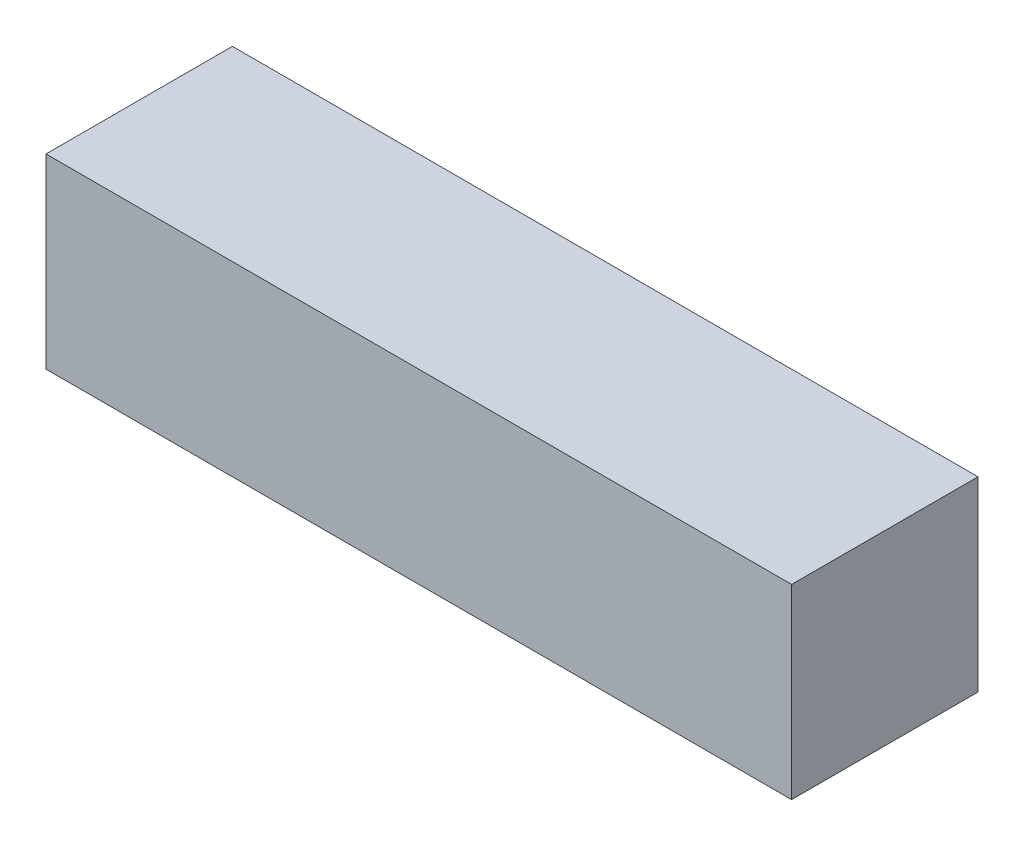
ISO-10303-21;
HEADER;
FILE_DESCRIPTION(('STEP AP214'),'2;1');
FILE_NAME('part.step','',(''),(''),'','','');
FILE_SCHEMA(('AUTOMOTIVE_DESIGN { 1 0 10303 214 1 1 1 1 }'));
ENDSEC;
DATA;
#1=APPLICATION_CONTEXT('core data for automotive mechanical design processes');
#2=APPLICATION_PROTOCOL_DEFINITION('international standard','automotive_design',2000,#1);
#3=PRODUCT_CONTEXT('',#1,'mechanical');
#4=PRODUCT('Part','Part','',(#3));
#5=PRODUCT_RELATED_PRODUCT_CATEGORY('part','',(#4));
#6=PRODUCT_DEFINITION_FORMATION('','',#4);
#7=PRODUCT_DEFINITION_CONTEXT('part definition',#1,'design');
#8=PRODUCT_DEFINITION('design','',#6,#7);
#9=PRODUCT_DEFINITION_SHAPE('','',#8);
#10=(LENGTH_UNIT() NAMED_UNIT(*) SI_UNIT(.MILLI.,.METRE.));
#11=(NAMED_UNIT(*) PLANE_ANGLE_UNIT() SI_UNIT($,.RADIAN.));
#12=(NAMED_UNIT(*) SI_UNIT($,.STERADIAN.) SOLID_ANGLE_UNIT());
#13=UNCERTAINTY_MEASURE_WITH_UNIT(LENGTH_MEASURE(1.E-05),#10,'distance_accuracy_value','');
#14=(GEOMETRIC_REPRESENTATION_CONTEXT(3) GLOBAL_UNCERTAINTY_ASSIGNED_CONTEXT((#13)) GLOBAL_UNIT_ASSIGNED_CONTEXT((#10,
#11,#12)) REPRESENTATION_CONTEXT('',''));
#15=CARTESIAN_POINT('',(0.,0.,0.));
#16=DIRECTION('',(0.,0.,1.));
#17=DIRECTION('',(1.,0.,0.));
#18=AXIS2_PLACEMENT_3D('',#15,#16,#17);
#19=CARTESIAN_POINT('',(0.,0.,3.175));
#20=DIRECTION('',(1.,0.,0.));
#21=DIRECTION('',(0.,0.,-1.));
#22=AXIS2_PLACEMENT_3D('',#19,#20,#21);
#23=PLANE('',#22);
#24=DIRECTION('',(0.,-1.,0.));
#25=VECTOR('',#24,1.);
#26=CARTESIAN_POINT('',(0.,0.,0.));
#27=LINE('',#26,#25);
#28=CARTESIAN_POINT('',(0.,3.175,0.));
#29=VERTEX_POINT('',#28);
#30=CARTESIAN_POINT('',(0.,0.,0.));
#31=VERTEX_POINT('',#30);
#32=EDGE_CURVE('E107',#29,#31,#27,.T.);
#33=ORIENTED_EDGE('',*,*,#32,.T.);
#34=DIRECTION('',(0.,0.,-1.));
#35=VECTOR('',#34,1.);
#36=CARTESIAN_POINT('',(0.,0.,3.175));
#37=LINE('',#36,#35);
#38=CARTESIAN_POINT('',(0.,0.,3.175));
#39=VERTEX_POINT('',#38);
#40=EDGE_CURVE('E11',#39,#31,#37,.T.);
#41=ORIENTED_EDGE('',*,*,#40,.F.);
#42=DIRECTION('',(0.,-1.,0.));
#43=VECTOR('',#42,1.);
#44=CARTESIAN_POINT('',(0.,0.,3.175));
#45=LINE('',#44,#43);
#46=CARTESIAN_POINT('',(0.,3.175,3.175));
#47=VERTEX_POINT('',#46);
#48=EDGE_CURVE('E91',#47,#39,#45,.T.);
#49=ORIENTED_EDGE('',*,*,#48,.F.);
#50=DIRECTION('',(0.,0.,-1.));
#51=VECTOR('',#50,1.);
#52=CARTESIAN_POINT('',(0.,3.175,3.175));
#53=LINE('',#52,#51);
#54=EDGE_CURVE('E103',#47,#29,#53,.T.);
#55=ORIENTED_EDGE('',*,*,#54,.T.);
#56=EDGE_LOOP('',(#33,#41,#49,#55));
#57=FACE_BOUND('',#56,.T.);
#58=ADVANCED_FACE('F39',(#57),#23,.F.);
#59=CARTESIAN_POINT('',(0.,0.,3.175));
#60=DIRECTION('',(0.,1.,0.));
#61=DIRECTION('',(0.,0.,1.));
#62=AXIS2_PLACEMENT_3D('',#59,#60,#61);
#63=PLANE('',#62);
#64=DIRECTION('',(1.,0.,0.));
#65=VECTOR('',#64,1.);
#66=CARTESIAN_POINT('',(0.,0.,0.));
#67=LINE('',#66,#65);
#68=CARTESIAN_POINT('',(12.7,0.,0.));
#69=VERTEX_POINT('',#68);
#70=EDGE_CURVE('E96',#31,#69,#67,.T.);
#71=ORIENTED_EDGE('',*,*,#70,.T.);
#72=DIRECTION('',(0.,0.,-1.));
#73=VECTOR('',#72,1.);
#74=CARTESIAN_POINT('',(12.7,0.,3.175));
#75=LINE('',#74,#73);
#76=CARTESIAN_POINT('',(12.7,0.,3.175));
#77=VERTEX_POINT('',#76);
#78=EDGE_CURVE('E48',#77,#69,#75,.T.);
#79=ORIENTED_EDGE('',*,*,#78,.F.);
#80=DIRECTION('',(1.,0.,0.));
#81=VECTOR('',#80,1.);
#82=CARTESIAN_POINT('',(0.,0.,3.175));
#83=LINE('',#82,#81);
#84=EDGE_CURVE('E86',#39,#77,#83,.T.);
#85=ORIENTED_EDGE('',*,*,#84,.F.);
#86=ORIENTED_EDGE('',*,*,#40,.T.);
#87=EDGE_LOOP('',(#71,#79,#85,#86));
#88=FACE_BOUND('',#87,.T.);
#89=ADVANCED_FACE('F95',(#88),#63,.F.);
#90=CARTESIAN_POINT('',(12.7,0.,3.175));
#91=DIRECTION('',(-1.,0.,0.));
#92=DIRECTION('',(0.,0.,1.));
#93=AXIS2_PLACEMENT_3D('',#90,#91,#92);
#94=PLANE('',#93);
#95=DIRECTION('',(0.,1.,0.));
#96=VECTOR('',#95,1.);
#97=CARTESIAN_POINT('',(12.7,0.,0.));
#98=LINE('',#97,#96);
#99=CARTESIAN_POINT('',(12.7,3.175,0.));
#100=VERTEX_POINT('',#99);
#101=EDGE_CURVE('E73',#69,#100,#98,.T.);
#102=ORIENTED_EDGE('',*,*,#101,.T.);
#103=DIRECTION('',(0.,0.,-1.));
#104=VECTOR('',#103,1.);
#105=CARTESIAN_POINT('',(12.7,3.175,3.175));
#106=LINE('',#105,#104);
#107=CARTESIAN_POINT('',(12.7,3.175,3.175));
#108=VERTEX_POINT('',#107);
#109=EDGE_CURVE('E98',#108,#100,#106,.T.);
#110=ORIENTED_EDGE('',*,*,#109,.F.);
#111=DIRECTION('',(0.,1.,0.));
#112=VECTOR('',#111,1.);
#113=CARTESIAN_POINT('',(12.7,0.,3.175));
#114=LINE('',#113,#112);
#115=EDGE_CURVE('E89',#77,#108,#114,.T.);
#116=ORIENTED_EDGE('',*,*,#115,.F.);
#117=ORIENTED_EDGE('',*,*,#78,.T.);
#118=EDGE_LOOP('',(#102,#110,#116,#117));
#119=FACE_BOUND('',#118,.T.);
#120=ADVANCED_FACE('F99',(#119),#94,.F.);
#121=CARTESIAN_POINT('',(0.,3.175,3.175));
#122=DIRECTION('',(0.,-1.,0.));
#123=DIRECTION('',(0.,0.,-1.));
#124=AXIS2_PLACEMENT_3D('',#121,#122,#123);
#125=PLANE('',#124);
#126=DIRECTION('',(-1.,0.,0.));
#127=VECTOR('',#126,1.);
#128=CARTESIAN_POINT('',(0.,3.175,0.));
#129=LINE('',#128,#127);
#130=EDGE_CURVE('E79',#100,#29,#129,.T.);
#131=ORIENTED_EDGE('',*,*,#130,.T.);
#132=ORIENTED_EDGE('',*,*,#54,.F.);
#133=DIRECTION('',(-1.,0.,0.));
#134=VECTOR('',#133,1.);
#135=CARTESIAN_POINT('',(0.,3.175,3.175));
#136=LINE('',#135,#134);
#137=EDGE_CURVE('E56',#108,#47,#136,.T.);
#138=ORIENTED_EDGE('',*,*,#137,.F.);
#139=ORIENTED_EDGE('',*,*,#109,.T.);
#140=EDGE_LOOP('',(#131,#132,#138,#139));
#141=FACE_BOUND('',#140,.T.);
#142=ADVANCED_FACE('F120',(#141),#125,.F.);
#143=CARTESIAN_POINT('',(0.,0.,3.175));
#144=DIRECTION('',(0.,0.,-1.));
#145=DIRECTION('',(-1.,0.,0.));
#146=AXIS2_PLACEMENT_3D('',#143,#144,#145);
#147=PLANE('',#146);
#148=ORIENTED_EDGE('',*,*,#48,.T.);
#149=ORIENTED_EDGE('',*,*,#84,.T.);
#150=ORIENTED_EDGE('',*,*,#115,.T.);
#151=ORIENTED_EDGE('',*,*,#137,.T.);
#152=EDGE_LOOP('',(#148,#149,#150,#151));
#153=FACE_BOUND('',#152,.T.);
#154=ADVANCED_FACE('F87',(#153),#147,.F.);
#155=CARTESIAN_POINT('',(0.,0.,0.));
#156=DIRECTION('',(0.,0.,-1.));
#157=DIRECTION('',(-1.,0.,0.));
#158=AXIS2_PLACEMENT_3D('',#155,#156,#157);
#159=PLANE('',#158);
#160=ORIENTED_EDGE('',*,*,#32,.F.);
#161=ORIENTED_EDGE('',*,*,#130,.F.);
#162=ORIENTED_EDGE('',*,*,#101,.F.);
#163=ORIENTED_EDGE('',*,*,#70,.F.);
#164=EDGE_LOOP('',(#160,#161,#162,#163));
#165=FACE_BOUND('',#164,.T.);
#166=ADVANCED_FACE('F123',(#165),#159,.T.);
#167=CLOSED_SHELL('',(#58,#89,#120,#142,#154,#166));
#168=MANIFOLD_SOLID_BREP('B2',#167);
#169=ADVANCED_BREP_SHAPE_REPRESENTATION('',(#18,#168),#14);
#170=SHAPE_DEFINITION_REPRESENTATION(#9,#169);
ENDSEC;
END-ISO-10303-21;
